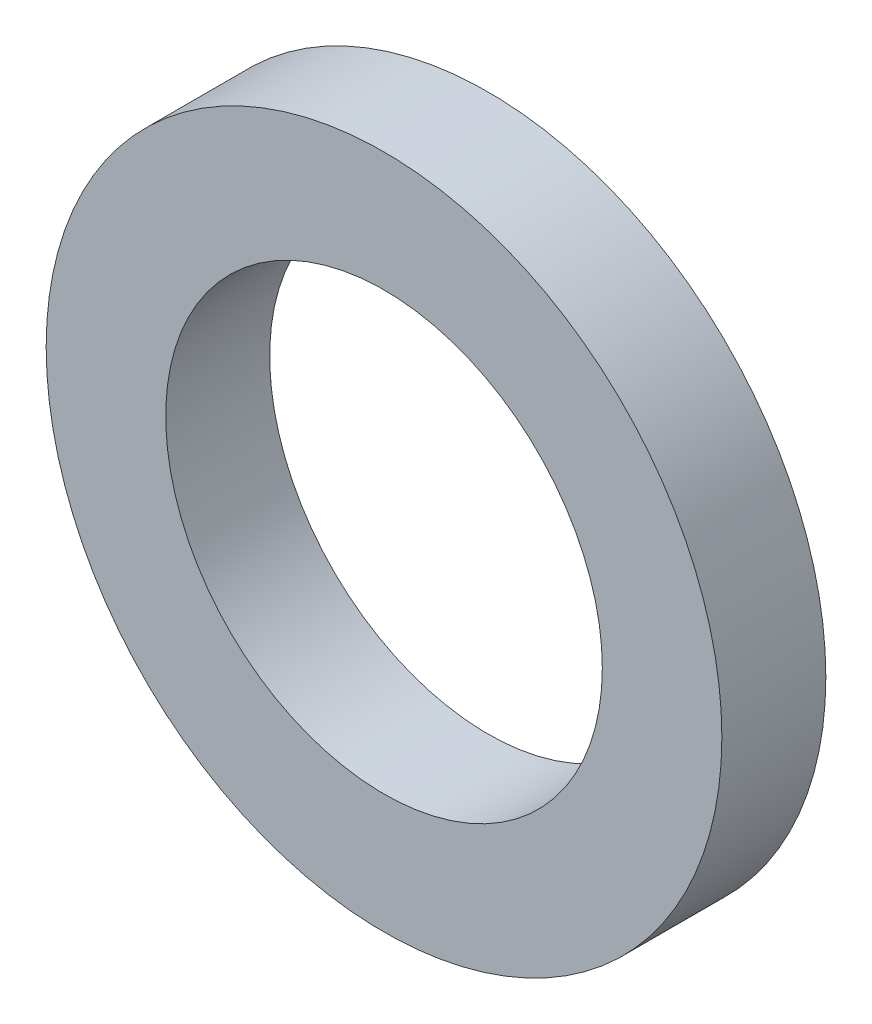
ISO-10303-21;
HEADER;
FILE_DESCRIPTION(('STEP AP214'),'2;1');
FILE_NAME('part.step','',(''),(''),'','','');
FILE_SCHEMA(('AUTOMOTIVE_DESIGN { 1 0 10303 214 1 1 1 1 }'));
ENDSEC;
DATA;
#1=APPLICATION_CONTEXT('core data for automotive mechanical design processes');
#2=APPLICATION_PROTOCOL_DEFINITION('international standard','automotive_design',2000,#1);
#3=PRODUCT_CONTEXT('',#1,'mechanical');
#4=PRODUCT('Part','Part','',(#3));
#5=PRODUCT_RELATED_PRODUCT_CATEGORY('part','',(#4));
#6=PRODUCT_DEFINITION_FORMATION('','',#4);
#7=PRODUCT_DEFINITION_CONTEXT('part definition',#1,'design');
#8=PRODUCT_DEFINITION('design','',#6,#7);
#9=PRODUCT_DEFINITION_SHAPE('','',#8);
#10=(LENGTH_UNIT() NAMED_UNIT(*) SI_UNIT(.MILLI.,.METRE.));
#11=(NAMED_UNIT(*) PLANE_ANGLE_UNIT() SI_UNIT($,.RADIAN.));
#12=(NAMED_UNIT(*) SI_UNIT($,.STERADIAN.) SOLID_ANGLE_UNIT());
#13=UNCERTAINTY_MEASURE_WITH_UNIT(LENGTH_MEASURE(1.E-05),#10,'distance_accuracy_value','');
#14=(GEOMETRIC_REPRESENTATION_CONTEXT(3) GLOBAL_UNCERTAINTY_ASSIGNED_CONTEXT((#13)) GLOBAL_UNIT_ASSIGNED_CONTEXT((#10,
#11,#12)) REPRESENTATION_CONTEXT('',''));
#15=CARTESIAN_POINT('',(0.,0.,0.));
#16=DIRECTION('',(0.,0.,1.));
#17=DIRECTION('',(1.,0.,0.));
#18=AXIS2_PLACEMENT_3D('',#15,#16,#17);
#19=CARTESIAN_POINT('',(0.,0.,2.));
#20=DIRECTION('',(0.,0.,1.));
#21=DIRECTION('',(1.,0.,0.));
#22=AXIS2_PLACEMENT_3D('',#19,#20,#21);
#23=PLANE('',#22);
#24=CARTESIAN_POINT('',(0.,0.,2.));
#25=DIRECTION('',(0.,0.,1.));
#26=DIRECTION('',(1.,0.,0.));
#27=AXIS2_PLACEMENT_3D('',#24,#25,#26);
#28=CIRCLE('',#27,6.5);
#29=CARTESIAN_POINT('',(6.5,0.,2.));
#30=VERTEX_POINT('',#29);
#31=EDGE_CURVE('E10',#30,#30,#28,.T.);
#32=ORIENTED_EDGE('',*,*,#31,.T.);
#33=EDGE_LOOP('',(#32));
#34=FACE_BOUND('',#33,.T.);
#35=CARTESIAN_POINT('',(0.,0.,2.));
#36=DIRECTION('',(0.,0.,1.));
#37=DIRECTION('',(1.,0.,0.));
#38=AXIS2_PLACEMENT_3D('',#35,#36,#37);
#39=CIRCLE('',#38,4.2);
#40=CARTESIAN_POINT('',(4.2,0.,2.));
#41=VERTEX_POINT('',#40);
#42=EDGE_CURVE('E42',#41,#41,#39,.T.);
#43=ORIENTED_EDGE('',*,*,#42,.F.);
#44=EDGE_LOOP('',(#43));
#45=FACE_BOUND('',#44,.T.);
#46=ADVANCED_FACE('F31',(#34,#45),#23,.T.);
#47=CARTESIAN_POINT('',(0.,0.,0.));
#48=DIRECTION('',(0.,0.,1.));
#49=DIRECTION('',(1.,0.,0.));
#50=AXIS2_PLACEMENT_3D('',#47,#48,#49);
#51=PLANE('',#50);
#52=CARTESIAN_POINT('',(0.,0.,0.));
#53=DIRECTION('',(0.,0.,1.));
#54=DIRECTION('',(1.,0.,0.));
#55=AXIS2_PLACEMENT_3D('',#52,#53,#54);
#56=CIRCLE('',#55,6.5);
#57=CARTESIAN_POINT('',(6.5,0.,0.));
#58=VERTEX_POINT('',#57);
#59=EDGE_CURVE('E35',#58,#58,#56,.T.);
#60=ORIENTED_EDGE('',*,*,#59,.F.);
#61=EDGE_LOOP('',(#60));
#62=FACE_BOUND('',#61,.T.);
#63=CARTESIAN_POINT('',(0.,0.,0.));
#64=DIRECTION('',(0.,0.,1.));
#65=DIRECTION('',(1.,0.,0.));
#66=AXIS2_PLACEMENT_3D('',#63,#64,#65);
#67=CIRCLE('',#66,4.2);
#68=CARTESIAN_POINT('',(4.2,0.,0.));
#69=VERTEX_POINT('',#68);
#70=EDGE_CURVE('E44',#69,#69,#67,.T.);
#71=ORIENTED_EDGE('',*,*,#70,.T.);
#72=EDGE_LOOP('',(#71));
#73=FACE_BOUND('',#72,.T.);
#74=ADVANCED_FACE('F54',(#62,#73),#51,.F.);
#75=CARTESIAN_POINT('',(0.,0.,2.));
#76=DIRECTION('',(0.,0.,-1.));
#77=DIRECTION('',(-1.,0.,0.));
#78=AXIS2_PLACEMENT_3D('',#75,#76,#77);
#79=CYLINDRICAL_SURFACE('',#78,6.5);
#80=ORIENTED_EDGE('',*,*,#31,.F.);
#81=EDGE_LOOP('',(#80));
#82=FACE_BOUND('',#81,.T.);
#83=ORIENTED_EDGE('',*,*,#59,.T.);
#84=EDGE_LOOP('',(#83));
#85=FACE_BOUND('',#84,.T.);
#86=ADVANCED_FACE('F33',(#82,#85),#79,.T.);
#87=CARTESIAN_POINT('',(0.,0.,2.));
#88=DIRECTION('',(0.,0.,-1.));
#89=DIRECTION('',(-1.,0.,0.));
#90=AXIS2_PLACEMENT_3D('',#87,#88,#89);
#91=CYLINDRICAL_SURFACE('',#90,4.2);
#92=ORIENTED_EDGE('',*,*,#42,.T.);
#93=EDGE_LOOP('',(#92));
#94=FACE_BOUND('',#93,.T.);
#95=ORIENTED_EDGE('',*,*,#70,.F.);
#96=EDGE_LOOP('',(#95));
#97=FACE_BOUND('',#96,.T.);
#98=ADVANCED_FACE('F50',(#94,#97),#91,.F.);
#99=CLOSED_SHELL('',(#46,#74,#86,#98));
#100=MANIFOLD_SOLID_BREP('B2',#99);
#101=ADVANCED_BREP_SHAPE_REPRESENTATION('',(#18,#100),#14);
#102=SHAPE_DEFINITION_REPRESENTATION(#9,#101);
ENDSEC;
END-ISO-10303-21;
